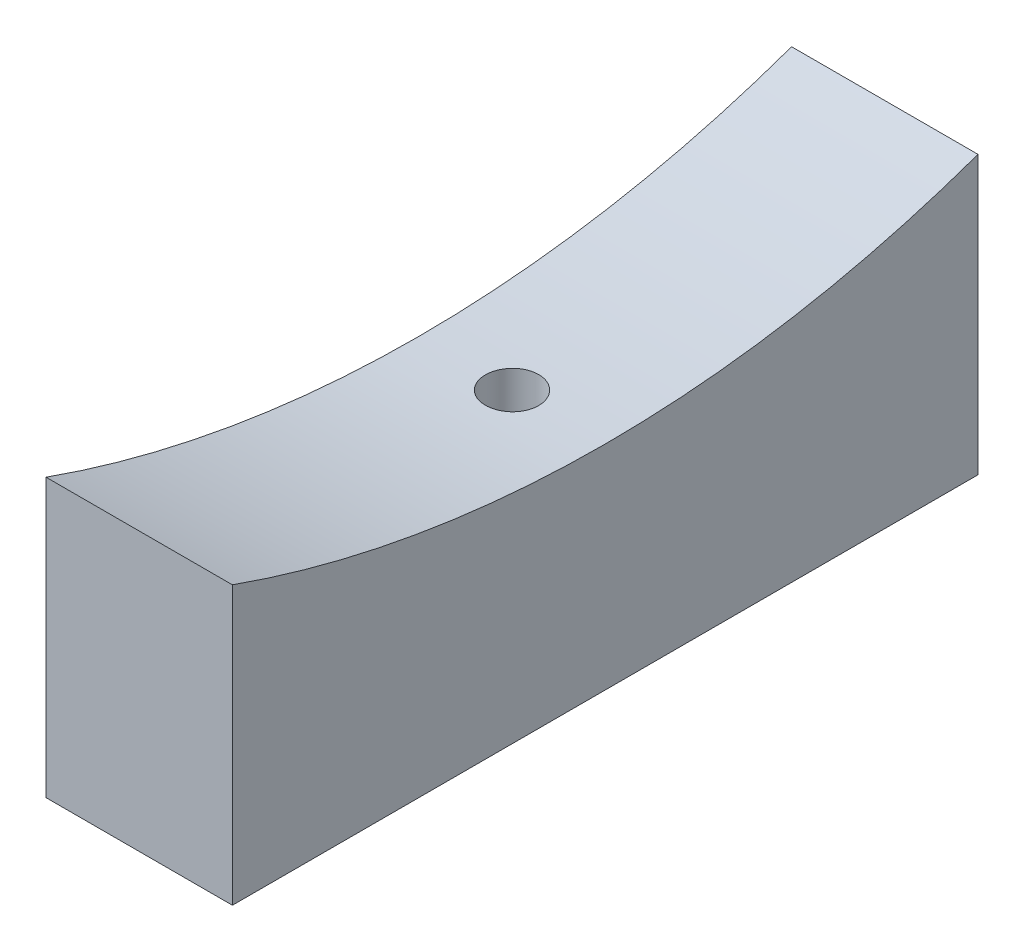
ISO-10303-21;
HEADER;
FILE_DESCRIPTION(('STEP AP214'),'2;1');
FILE_NAME('part.step','',(''),(''),'','','');
FILE_SCHEMA(('AUTOMOTIVE_DESIGN { 1 0 10303 214 1 1 1 1 }'));
ENDSEC;
DATA;
#1=APPLICATION_CONTEXT('core data for automotive mechanical design processes');
#2=APPLICATION_PROTOCOL_DEFINITION('international standard','automotive_design',2000,#1);
#3=PRODUCT_CONTEXT('',#1,'mechanical');
#4=PRODUCT('Part','Part','',(#3));
#5=PRODUCT_RELATED_PRODUCT_CATEGORY('part','',(#4));
#6=PRODUCT_DEFINITION_FORMATION('','',#4);
#7=PRODUCT_DEFINITION_CONTEXT('part definition',#1,'design');
#8=PRODUCT_DEFINITION('design','',#6,#7);
#9=PRODUCT_DEFINITION_SHAPE('','',#8);
#10=(LENGTH_UNIT() NAMED_UNIT(*) SI_UNIT(.MILLI.,.METRE.));
#11=(NAMED_UNIT(*) PLANE_ANGLE_UNIT() SI_UNIT($,.RADIAN.));
#12=(NAMED_UNIT(*) SI_UNIT($,.STERADIAN.) SOLID_ANGLE_UNIT());
#13=UNCERTAINTY_MEASURE_WITH_UNIT(LENGTH_MEASURE(1.E-05),#10,'distance_accuracy_value','');
#14=(GEOMETRIC_REPRESENTATION_CONTEXT(3) GLOBAL_UNCERTAINTY_ASSIGNED_CONTEXT((#13)) GLOBAL_UNIT_ASSIGNED_CONTEXT((#10,
#11,#12)) REPRESENTATION_CONTEXT('',''));
#15=CARTESIAN_POINT('',(0.,0.,0.));
#16=DIRECTION('',(0.,0.,1.));
#17=DIRECTION('',(1.,0.,0.));
#18=AXIS2_PLACEMENT_3D('',#15,#16,#17);
#19=CARTESIAN_POINT('',(10.5,-117.731748205416,0.));
#20=DIRECTION('',(0.,-1.,0.));
#21=DIRECTION('',(0.,0.,-1.));
#22=AXIS2_PLACEMENT_3D('',#19,#20,#21);
#23=CYLINDRICAL_SURFACE('',#22,3.);
#24=CARTESIAN_POINT('',(10.5,-124.963994814506,-3.));
#25=CARTESIAN_POINT('',(10.3315147206339,-124.963995300738,-2.99999253634759));
#26=CARTESIAN_POINT('',(10.162907891144,-124.96433921995,-2.9857587186884));
#27=CARTESIAN_POINT('',(9.8303395382123,-124.965678086535,-2.92917571675181));
#28=CARTESIAN_POINT('',(9.6663838245003,-124.96667381369,-2.8867928558567));
#29=CARTESIAN_POINT('',(9.34798379581215,-124.969203434744,-2.77512060796775));
#30=CARTESIAN_POINT('',(9.19353490941648,-124.970737067573,-2.70584427184243));
#31=CARTESIAN_POINT('',(8.89850242585282,-124.974169355582,-2.54237000921784));
#32=CARTESIAN_POINT('',(8.7579154329609,-124.976067921026,-2.44817820714248));
#33=CARTESIAN_POINT('',(8.49450563517485,-124.980016917553,-2.23750767123847));
#34=CARTESIAN_POINT('',(8.37168789694719,-124.9820673917,-2.12102260268739));
#35=CARTESIAN_POINT('',(8.14734522584831,-124.986088708592,-1.86908213847914));
#36=CARTESIAN_POINT('',(8.04582113667501,-124.98805954818,-1.73362599150356));
#37=CARTESIAN_POINT('',(7.86694353702028,-124.99169955895,-1.44757452639053));
#38=CARTESIAN_POINT('',(7.78959249340766,-124.993368699337,-1.29697766520859));
#39=CARTESIAN_POINT('',(7.66127299569743,-124.996216871393,-0.984930786065394));
#40=CARTESIAN_POINT('',(7.61030445482318,-124.997395904675,-0.823480803803911));
#41=CARTESIAN_POINT('',(7.5362060937168,-124.999130748725,-0.494343631663761));
#42=CARTESIAN_POINT('',(7.51307089260358,-124.999686679953,-0.326657653823338));
#43=CARTESIAN_POINT('',(7.49527937997061,-125.000113052879,0.010218806905178));
#44=CARTESIAN_POINT('',(7.50062297725837,-124.999983496773,0.179409284973951));
#45=CARTESIAN_POINT('',(7.53963276790326,-124.999053604532,0.514455556398486));
#46=CARTESIAN_POINT('',(7.57329313405078,-124.998253406407,0.680312028658235));
#47=CARTESIAN_POINT('',(7.66797196498704,-124.99607258453,1.00401939372881));
#48=CARTESIAN_POINT('',(7.72899047868434,-124.994691959742,1.16187027222735));
#49=CARTESIAN_POINT('',(7.87666018632706,-124.991505668754,1.46510427131606));
#50=CARTESIAN_POINT('',(7.96331405252427,-124.989699958248,1.61048609008145));
#51=CARTESIAN_POINT('',(8.15979265008908,-124.985867024304,1.88464076969137));
#52=CARTESIAN_POINT('',(8.26961741197684,-124.983839800575,2.01341360865856));
#53=CARTESIAN_POINT('',(8.50935327663566,-124.979791731022,2.25072892580086));
#54=CARTESIAN_POINT('',(8.63926943980058,-124.977770886937,2.35926629206316));
#55=CARTESIAN_POINT('',(8.91548236919061,-124.973963924259,2.55299030774415));
#56=CARTESIAN_POINT('',(9.06177913788156,-124.9721778057,2.63817695364779));
#57=CARTESIAN_POINT('',(9.36660322639371,-124.96904171854,2.78278077867496));
#58=CARTESIAN_POINT('',(9.52513062211373,-124.967691752645,2.84219779786644));
#59=CARTESIAN_POINT('',(9.84991461467511,-124.965580298162,2.93357245531345));
#60=CARTESIAN_POINT('',(10.0161711979127,-124.964818808539,2.96553014189696));
#61=CARTESIAN_POINT('',(10.3516496434169,-124.96397035046,3.00107270336581));
#62=CARTESIAN_POINT('',(10.520870755396,-124.963883213736,3.00466465621751));
#63=CARTESIAN_POINT('',(10.8575136703444,-124.964392847252,2.98339222614066));
#64=CARTESIAN_POINT('',(11.0249354746182,-124.964989616995,2.95852786384474));
#65=CARTESIAN_POINT('',(11.3532075027215,-124.966799633731,2.88105447861535));
#66=CARTESIAN_POINT('',(11.5140584848846,-124.968012809367,2.82844866710453));
#67=CARTESIAN_POINT('',(11.8246461069798,-124.970918810348,2.69698894741913));
#68=CARTESIAN_POINT('',(11.9743827331054,-124.97261163629,2.61813500663941));
#69=CARTESIAN_POINT('',(12.2585237330224,-124.976286509322,2.43639917391487));
#70=CARTESIAN_POINT('',(12.3929250561735,-124.978268613781,2.33351251352039));
#71=CARTESIAN_POINT('',(12.6425496354754,-124.982298388317,2.1066388367222));
#72=CARTESIAN_POINT('',(12.7577728575213,-124.984346058509,1.98265178279595));
#73=CARTESIAN_POINT('',(12.9657940090097,-124.988276610311,1.7170665927773));
#74=CARTESIAN_POINT('',(13.0585873731523,-124.990159458323,1.57546488032335));
#75=CARTESIAN_POINT('',(13.2190834751684,-124.993547629945,1.27868830701356));
#76=CARTESIAN_POINT('',(13.2867862587807,-124.995052954243,1.12351347090148));
#77=CARTESIAN_POINT('',(13.3951713819732,-124.997516220595,0.804012759537138));
#78=CARTESIAN_POINT('',(13.4358566886281,-124.998474222754,0.639687891295599));
#79=CARTESIAN_POINT('',(13.4890616930417,-124.999735086494,0.306537330600023));
#80=CARTESIAN_POINT('',(13.501581388304,-125.000037948017,0.137711637747073));
#81=CARTESIAN_POINT('',(13.498099398777,-124.999954391076,-0.19960230678041));
#82=CARTESIAN_POINT('',(13.4821049260912,-124.999568146909,-0.368090632994643));
#83=CARTESIAN_POINT('',(13.4220634169068,-124.998150250327,-0.699989971426411));
#84=CARTESIAN_POINT('',(13.3780163245101,-124.997118596627,-0.863400973526118));
#85=CARTESIAN_POINT('',(13.263120526695,-124.994526113701,-1.18051072368374));
#86=CARTESIAN_POINT('',(13.1922713477009,-124.992965275124,-1.33420930007332));
#87=CARTESIAN_POINT('',(13.0257861123582,-124.989490356605,-1.62752606008139));
#88=CARTESIAN_POINT('',(12.9301509800422,-124.987576289832,-1.76714476833482));
#89=CARTESIAN_POINT('',(12.7167915320369,-124.983610199171,-2.02836906914305));
#90=CARTESIAN_POINT('',(12.5990639820808,-124.981558155112,-2.14997201957207));
#91=CARTESIAN_POINT('',(12.3448303725468,-124.977547105533,-2.37171984509409));
#92=CARTESIAN_POINT('',(12.2083196640906,-124.975588123208,-2.47185939219898));
#93=CARTESIAN_POINT('',(11.920352082395,-124.971983553146,-2.64784891272756));
#94=CARTESIAN_POINT('',(11.7688864889408,-124.970338149916,-2.72368460381245));
#95=CARTESIAN_POINT('',(11.4554868259454,-124.967549807618,-2.84876220799889));
#96=CARTESIAN_POINT('',(11.2935655243164,-124.966406268532,-2.89803589426928));
#97=CARTESIAN_POINT('',(11.0255150782667,-124.965056868599,-2.9555059501541));
#98=CARTESIAN_POINT('',(10.921126483324,-124.964660323356,-2.97217028592491));
#99=CARTESIAN_POINT('',(10.7111745116158,-124.964129143943,-2.99441964902103));
#100=CARTESIAN_POINT('',(10.6056111350702,-124.963994509723,-3.00000467841942));
#101=CARTESIAN_POINT('',(10.5,-124.963994814506,-3.));
#102=B_SPLINE_CURVE_WITH_KNOTS('',3,(#24,#25,#26,#27,#28,#29,#30,#31,#32,#33,#34,#35,#36,#37,
#38,#39,#40,#41,#42,#43,#44,#45,#46,#47,#48,#49,#50,#51,#52,#53,#54,#55,#56,#57,#58,#59,#60,#61,
#62,#63,#64,#65,#66,#67,#68,#69,#70,#71,#72,#73,#74,#75,#76,#77,#78,#79,#80,#81,#82,#83,#84,#85,
#86,#87,#88,#89,#90,#91,#92,#93,#94,#95,#96,#97,#98,#99,#100,#101),.UNSPECIFIED.,.T.,.F.,(4,2,2,
2,2,2,2,2,2,2,2,2,2,2,2,2,2,2,2,2,2,2,2,2,2,2,2,2,2,2,2,2,2,2,2,2,2,2,4),(0.,0.505070348724208,
1.01074603858355,1.51617664023111,2.02148311819683,2.52693339481627,3.0324036946275,
3.53792556105008,4.04344576471291,4.54886822295731,5.05428906277998,5.55960591923736,
6.06492367906088,6.57029413222602,7.07566525105782,7.58116386495594,8.08666255494841,
8.59216438213387,9.09766531964242,9.60304011792407,10.1084145497772,10.6137304910041,
11.1190470599313,11.6244639764893,12.129881791833,12.6354023918045,13.1409220702324,
13.6463862230153,14.1518504205983,14.6571867889941,15.1625241643335,15.6678704690766,
16.1731979369693,16.6785994411523,17.1841262592224,17.6899496113893,18.1951665531647,
18.5117583824363,18.8283501524696),.UNSPECIFIED.);
#103=CARTESIAN_POINT('',(10.5,-124.963994814506,-3.));
#104=VERTEX_POINT('',#103);
#105=EDGE_CURVE('E104',#104,#104,#102,.T.);
#106=ORIENTED_EDGE('',*,*,#105,.T.);
#107=EDGE_LOOP('',(#106));
#108=FACE_BOUND('',#107,.T.);
#109=CARTESIAN_POINT('',(10.5,-139.,0.));
#110=DIRECTION('',(0.,-1.,0.));
#111=DIRECTION('',(0.,0.,-1.));
#112=AXIS2_PLACEMENT_3D('',#109,#110,#111);
#113=CIRCLE('',#112,3.);
#114=CARTESIAN_POINT('',(10.5,-139.,-3.));
#115=VERTEX_POINT('',#114);
#116=EDGE_CURVE('E39',#115,#115,#113,.F.);
#117=ORIENTED_EDGE('',*,*,#116,.F.);
#118=EDGE_LOOP('',(#117));
#119=FACE_BOUND('',#118,.T.);
#120=ADVANCED_FACE('F35',(#108,#119),#23,.F.);
#121=CARTESIAN_POINT('',(21.,0.,0.));
#122=DIRECTION('',(-1.,0.,0.));
#123=DIRECTION('',(0.,0.,1.));
#124=AXIS2_PLACEMENT_3D('',#121,#122,#123);
#125=CYLINDRICAL_SURFACE('',#124,125.);
#126=ORIENTED_EDGE('',*,*,#105,.F.);
#127=EDGE_LOOP('',(#126));
#128=FACE_BOUND('',#127,.T.);
#129=CARTESIAN_POINT('',(0.,0.,0.));
#130=DIRECTION('',(-1.,0.,0.));
#131=DIRECTION('',(0.,0.,-1.));
#132=AXIS2_PLACEMENT_3D('',#129,#130,#131);
#133=CIRCLE('',#132,125.);
#134=CARTESIAN_POINT('',(0.,-117.732748205416,-42.));
#135=VERTEX_POINT('',#134);
#136=CARTESIAN_POINT('',(0.,-117.732748205416,42.));
#137=VERTEX_POINT('',#136);
#138=EDGE_CURVE('E101',#135,#137,#133,.T.);
#139=ORIENTED_EDGE('',*,*,#138,.T.);
#140=DIRECTION('',(-1.,0.,0.));
#141=VECTOR('',#140,1.);
#142=CARTESIAN_POINT('',(21.,-117.732748205416,42.));
#143=LINE('',#142,#141);
#144=CARTESIAN_POINT('',(21.,-117.732748205416,42.));
#145=VERTEX_POINT('',#144);
#146=EDGE_CURVE('E11',#145,#137,#143,.T.);
#147=ORIENTED_EDGE('',*,*,#146,.F.);
#148=CARTESIAN_POINT('',(21.,0.,0.));
#149=DIRECTION('',(-1.,0.,0.));
#150=DIRECTION('',(0.,0.,-1.));
#151=AXIS2_PLACEMENT_3D('',#148,#149,#150);
#152=CIRCLE('',#151,125.);
#153=CARTESIAN_POINT('',(21.,-117.732748205416,-42.));
#154=VERTEX_POINT('',#153);
#155=EDGE_CURVE('E88',#154,#145,#152,.T.);
#156=ORIENTED_EDGE('',*,*,#155,.F.);
#157=DIRECTION('',(-1.,0.,0.));
#158=VECTOR('',#157,1.);
#159=CARTESIAN_POINT('',(21.,-117.732748205416,-42.));
#160=LINE('',#159,#158);
#161=EDGE_CURVE('E97',#154,#135,#160,.T.);
#162=ORIENTED_EDGE('',*,*,#161,.T.);
#163=EDGE_LOOP('',(#139,#147,#156,#162));
#164=FACE_BOUND('',#163,.T.);
#165=ADVANCED_FACE('F37',(#128,#164),#125,.F.);
#166=CARTESIAN_POINT('',(21.,-117.732748205416,42.));
#167=DIRECTION('',(0.,0.,-1.));
#168=DIRECTION('',(0.,1.,0.));
#169=AXIS2_PLACEMENT_3D('',#166,#167,#168);
#170=PLANE('',#169);
#171=DIRECTION('',(0.,-1.,0.));
#172=VECTOR('',#171,1.);
#173=CARTESIAN_POINT('',(0.,-117.732748205416,42.));
#174=LINE('',#173,#172);
#175=CARTESIAN_POINT('',(0.,-149.,42.));
#176=VERTEX_POINT('',#175);
#177=EDGE_CURVE('E92',#137,#176,#174,.T.);
#178=ORIENTED_EDGE('',*,*,#177,.T.);
#179=DIRECTION('',(-1.,0.,0.));
#180=VECTOR('',#179,1.);
#181=CARTESIAN_POINT('',(21.,-149.,42.));
#182=LINE('',#181,#180);
#183=CARTESIAN_POINT('',(21.,-149.,42.));
#184=VERTEX_POINT('',#183);
#185=EDGE_CURVE('E45',#184,#176,#182,.T.);
#186=ORIENTED_EDGE('',*,*,#185,.F.);
#187=DIRECTION('',(0.,-1.,0.));
#188=VECTOR('',#187,1.);
#189=CARTESIAN_POINT('',(21.,-117.732748205416,42.));
#190=LINE('',#189,#188);
#191=EDGE_CURVE('E83',#145,#184,#190,.T.);
#192=ORIENTED_EDGE('',*,*,#191,.F.);
#193=ORIENTED_EDGE('',*,*,#146,.T.);
#194=EDGE_LOOP('',(#178,#186,#192,#193));
#195=FACE_BOUND('',#194,.T.);
#196=ADVANCED_FACE('F91',(#195),#170,.F.);
#197=CARTESIAN_POINT('',(21.,-149.,42.));
#198=DIRECTION('',(0.,1.,0.));
#199=DIRECTION('',(0.,0.,1.));
#200=AXIS2_PLACEMENT_3D('',#197,#198,#199);
#201=PLANE('',#200);
#202=CARTESIAN_POINT('',(10.5602102111106,-149.,0.));
#203=DIRECTION('',(0.,-1.,0.));
#204=DIRECTION('',(0.,0.,-1.));
#205=AXIS2_PLACEMENT_3D('',#202,#203,#204);
#206=CIRCLE('',#205,6.);
#207=CARTESIAN_POINT('',(10.5602102111106,-149.,-6.));
#208=VERTEX_POINT('',#207);
#209=EDGE_CURVE('E121',#208,#208,#206,.T.);
#210=ORIENTED_EDGE('',*,*,#209,.F.);
#211=EDGE_LOOP('',(#210));
#212=FACE_BOUND('',#211,.T.);
#213=DIRECTION('',(0.,0.,-1.));
#214=VECTOR('',#213,1.);
#215=CARTESIAN_POINT('',(0.,-149.,42.));
#216=LINE('',#215,#214);
#217=CARTESIAN_POINT('',(0.,-149.,-42.));
#218=VERTEX_POINT('',#217);
#219=EDGE_CURVE('E70',#176,#218,#216,.T.);
#220=ORIENTED_EDGE('',*,*,#219,.T.);
#221=DIRECTION('',(-1.,0.,0.));
#222=VECTOR('',#221,1.);
#223=CARTESIAN_POINT('',(21.,-149.,-42.));
#224=LINE('',#223,#222);
#225=CARTESIAN_POINT('',(21.,-149.,-42.));
#226=VERTEX_POINT('',#225);
#227=EDGE_CURVE('E93',#226,#218,#224,.T.);
#228=ORIENTED_EDGE('',*,*,#227,.F.);
#229=DIRECTION('',(0.,0.,-1.));
#230=VECTOR('',#229,1.);
#231=CARTESIAN_POINT('',(21.,-149.,42.));
#232=LINE('',#231,#230);
#233=EDGE_CURVE('E86',#184,#226,#232,.T.);
#234=ORIENTED_EDGE('',*,*,#233,.F.);
#235=ORIENTED_EDGE('',*,*,#185,.T.);
#236=EDGE_LOOP('',(#220,#228,#234,#235));
#237=FACE_BOUND('',#236,.T.);
#238=ADVANCED_FACE('F95',(#212,#237),#201,.F.);
#239=CARTESIAN_POINT('',(21.,-149.,-42.));
#240=DIRECTION('',(0.,0.,1.));
#241=DIRECTION('',(0.,-1.,0.));
#242=AXIS2_PLACEMENT_3D('',#239,#240,#241);
#243=PLANE('',#242);
#244=DIRECTION('',(0.,1.,0.));
#245=VECTOR('',#244,1.);
#246=CARTESIAN_POINT('',(0.,-149.,-42.));
#247=LINE('',#246,#245);
#248=EDGE_CURVE('E76',#218,#135,#247,.T.);
#249=ORIENTED_EDGE('',*,*,#248,.T.);
#250=ORIENTED_EDGE('',*,*,#161,.F.);
#251=DIRECTION('',(0.,1.,0.));
#252=VECTOR('',#251,1.);
#253=CARTESIAN_POINT('',(21.,-149.,-42.));
#254=LINE('',#253,#252);
#255=EDGE_CURVE('E53',#226,#154,#254,.T.);
#256=ORIENTED_EDGE('',*,*,#255,.F.);
#257=ORIENTED_EDGE('',*,*,#227,.T.);
#258=EDGE_LOOP('',(#249,#250,#256,#257));
#259=FACE_BOUND('',#258,.T.);
#260=ADVANCED_FACE('F109',(#259),#243,.F.);
#261=CARTESIAN_POINT('',(21.,0.,0.));
#262=DIRECTION('',(1.,0.,0.));
#263=DIRECTION('',(0.,0.,-1.));
#264=AXIS2_PLACEMENT_3D('',#261,#262,#263);
#265=PLANE('',#264);
#266=ORIENTED_EDGE('',*,*,#155,.T.);
#267=ORIENTED_EDGE('',*,*,#191,.T.);
#268=ORIENTED_EDGE('',*,*,#233,.T.);
#269=ORIENTED_EDGE('',*,*,#255,.T.);
#270=EDGE_LOOP('',(#266,#267,#268,#269));
#271=FACE_BOUND('',#270,.T.);
#272=ADVANCED_FACE('F84',(#271),#265,.T.);
#273=CARTESIAN_POINT('',(0.,0.,0.));
#274=DIRECTION('',(1.,0.,0.));
#275=DIRECTION('',(0.,0.,-1.));
#276=AXIS2_PLACEMENT_3D('',#273,#274,#275);
#277=PLANE('',#276);
#278=ORIENTED_EDGE('',*,*,#138,.F.);
#279=ORIENTED_EDGE('',*,*,#248,.F.);
#280=ORIENTED_EDGE('',*,*,#219,.F.);
#281=ORIENTED_EDGE('',*,*,#177,.F.);
#282=EDGE_LOOP('',(#278,#279,#280,#281));
#283=FACE_BOUND('',#282,.T.);
#284=ADVANCED_FACE('F112',(#283),#277,.F.);
#285=CARTESIAN_POINT('',(10.5602102111106,-139.,0.));
#286=DIRECTION('',(0.,-1.,0.));
#287=DIRECTION('',(0.,0.,-1.));
#288=AXIS2_PLACEMENT_3D('',#285,#286,#287);
#289=PLANE('',#288);
#290=CARTESIAN_POINT('',(10.5602102111106,-139.,0.));
#291=DIRECTION('',(0.,-1.,0.));
#292=DIRECTION('',(0.,0.,-1.));
#293=AXIS2_PLACEMENT_3D('',#290,#291,#292);
#294=CIRCLE('',#293,6.);
#295=CARTESIAN_POINT('',(10.5602102111106,-139.,-6.));
#296=VERTEX_POINT('',#295);
#297=EDGE_CURVE('E153',#296,#296,#294,.T.);
#298=ORIENTED_EDGE('',*,*,#297,.T.);
#299=EDGE_LOOP('',(#298));
#300=FACE_BOUND('',#299,.T.);
#301=ORIENTED_EDGE('',*,*,#116,.T.);
#302=EDGE_LOOP('',(#301));
#303=FACE_BOUND('',#302,.T.);
#304=ADVANCED_FACE('F130',(#300,#303),#289,.T.);
#305=CARTESIAN_POINT('',(10.5602102111106,-139.,0.));
#306=DIRECTION('',(0.,-1.,0.));
#307=DIRECTION('',(0.,0.,-1.));
#308=AXIS2_PLACEMENT_3D('',#305,#306,#307);
#309=CYLINDRICAL_SURFACE('',#308,6.);
#310=ORIENTED_EDGE('',*,*,#297,.F.);
#311=EDGE_LOOP('',(#310));
#312=FACE_BOUND('',#311,.T.);
#313=ORIENTED_EDGE('',*,*,#209,.T.);
#314=EDGE_LOOP('',(#313));
#315=FACE_BOUND('',#314,.T.);
#316=ADVANCED_FACE('F127',(#312,#315),#309,.F.);
#317=CLOSED_SHELL('',(#120,#165,#196,#238,#260,#272,#284,#304,#316));
#318=MANIFOLD_SOLID_BREP('B2',#317);
#319=ADVANCED_BREP_SHAPE_REPRESENTATION('',(#18,#318),#14);
#320=SHAPE_DEFINITION_REPRESENTATION(#9,#319);
ENDSEC;
END-ISO-10303-21;
